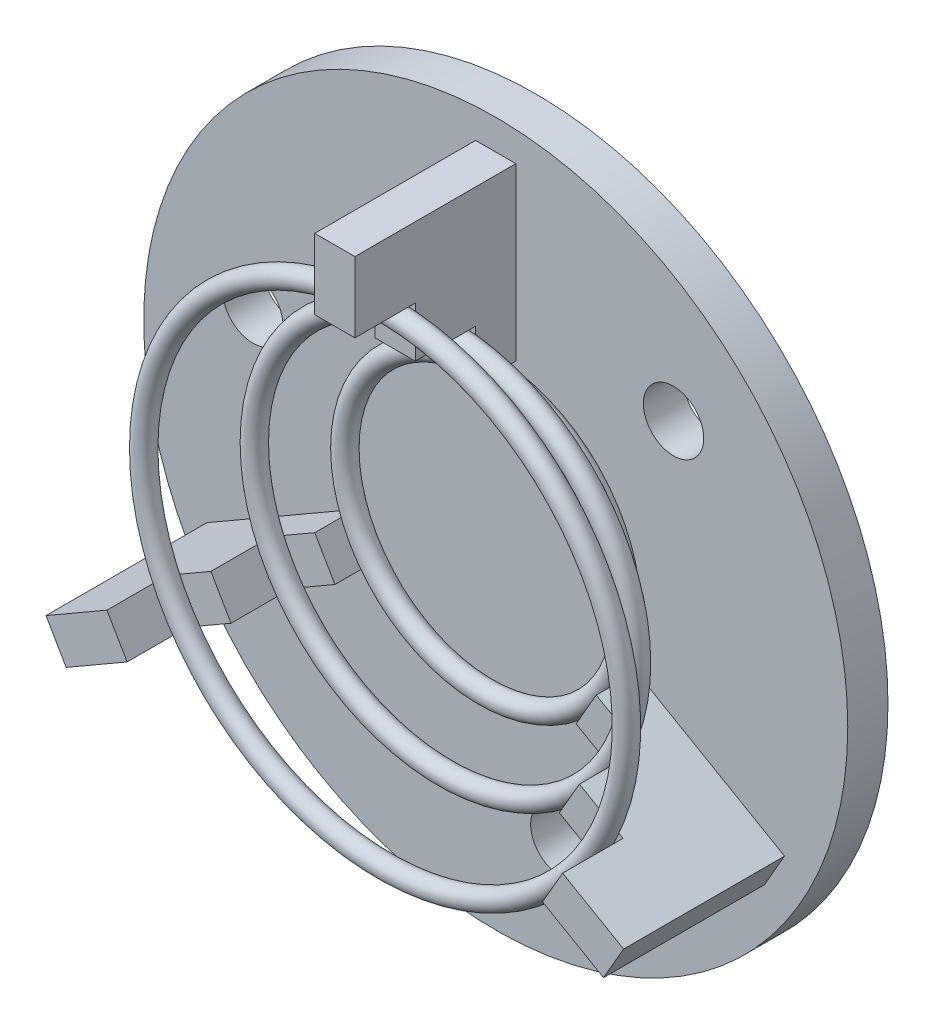
ISO-10303-21;
HEADER;
FILE_DESCRIPTION(('STEP AP214'),'2;1');
FILE_NAME('part.step','',(''),(''),'','','');
FILE_SCHEMA(('AUTOMOTIVE_DESIGN { 1 0 10303 214 1 1 1 1 }'));
ENDSEC;
DATA;
#1=APPLICATION_CONTEXT('core data for automotive mechanical design processes');
#2=APPLICATION_PROTOCOL_DEFINITION('international standard','automotive_design',2000,#1);
#3=PRODUCT_CONTEXT('',#1,'mechanical');
#4=PRODUCT('Part','Part','',(#3));
#5=PRODUCT_RELATED_PRODUCT_CATEGORY('part','',(#4));
#6=PRODUCT_DEFINITION_FORMATION('','',#4);
#7=PRODUCT_DEFINITION_CONTEXT('part definition',#1,'design');
#8=PRODUCT_DEFINITION('design','',#6,#7);
#9=PRODUCT_DEFINITION_SHAPE('','',#8);
#10=(LENGTH_UNIT() NAMED_UNIT(*) SI_UNIT(.MILLI.,.METRE.));
#11=(NAMED_UNIT(*) PLANE_ANGLE_UNIT() SI_UNIT($,.RADIAN.));
#12=(NAMED_UNIT(*) SI_UNIT($,.STERADIAN.) SOLID_ANGLE_UNIT());
#13=UNCERTAINTY_MEASURE_WITH_UNIT(LENGTH_MEASURE(1.E-05),#10,'distance_accuracy_value','');
#14=(GEOMETRIC_REPRESENTATION_CONTEXT(3) GLOBAL_UNCERTAINTY_ASSIGNED_CONTEXT((#13)) GLOBAL_UNIT_ASSIGNED_CONTEXT((#10,
#11,#12)) REPRESENTATION_CONTEXT('',''));
#15=CARTESIAN_POINT('',(0.,0.,0.));
#16=DIRECTION('',(0.,0.,1.));
#17=DIRECTION('',(1.,0.,0.));
#18=AXIS2_PLACEMENT_3D('',#15,#16,#17);
#19=CARTESIAN_POINT('',(0.,0.,7.5));
#20=DIRECTION('',(0.,0.,1.));
#21=DIRECTION('',(1.,0.,0.));
#22=AXIS2_PLACEMENT_3D('',#19,#20,#21);
#23=TOROIDAL_SURFACE('',#22,12.,0.500000000000001);
#24=CARTESIAN_POINT('',(-12.,0.,7.5));
#25=DIRECTION('',(0.,1.,0.));
#26=DIRECTION('',(0.,0.,1.));
#27=AXIS2_PLACEMENT_3D('',#24,#25,#26);
#28=CIRCLE('',#27,0.500000000000001);
#29=CARTESIAN_POINT('',(-12.5,0.,7.5));
#30=VERTEX_POINT('',#29);
#31=EDGE_CURVE('E11',#30,#30,#28,.T.);
#32=CARTESIAN_POINT('',(0.,0.,7.5));
#33=DIRECTION('',(0.,0.,1.));
#34=DIRECTION('',(1.,0.,0.));
#35=AXIS2_PLACEMENT_3D('',#32,#33,#34);
#36=CIRCLE('',#35,12.5);
#37=EDGE_CURVE('',#30,#30,#36,.T.);
#38=ORIENTED_EDGE('',*,*,#31,.F.);
#39=ORIENTED_EDGE('',*,*,#31,.T.);
#40=ORIENTED_EDGE('',*,*,#37,.T.);
#41=ORIENTED_EDGE('',*,*,#37,.F.);
#42=EDGE_LOOP('',(#38,#40,#39,#41));
#43=FACE_BOUND('',#42,.T.);
#44=ADVANCED_FACE('F43',(#43),#23,.T.);
#45=CLOSED_SHELL('',(#44));
#46=MANIFOLD_SOLID_BREP('B2',#45);
#47=CARTESIAN_POINT('',(0.,0.,4.5));
#48=DIRECTION('',(0.,0.,1.));
#49=DIRECTION('',(1.,0.,0.));
#50=AXIS2_PLACEMENT_3D('',#47,#48,#49);
#51=TOROIDAL_SURFACE('',#50,9.5,0.500000000000001);
#52=CARTESIAN_POINT('',(-9.5,0.,4.5));
#53=DIRECTION('',(0.,1.,0.));
#54=DIRECTION('',(0.,0.,1.));
#55=AXIS2_PLACEMENT_3D('',#52,#53,#54);
#56=CIRCLE('',#55,0.500000000000001);
#57=CARTESIAN_POINT('',(-10.,0.,4.5));
#58=VERTEX_POINT('',#57);
#59=EDGE_CURVE('E42',#58,#58,#56,.T.);
#60=CARTESIAN_POINT('',(0.,0.,4.5));
#61=DIRECTION('',(0.,0.,1.));
#62=DIRECTION('',(1.,0.,0.));
#63=AXIS2_PLACEMENT_3D('',#60,#61,#62);
#64=CIRCLE('',#63,10.);
#65=EDGE_CURVE('',#58,#58,#64,.T.);
#66=ORIENTED_EDGE('',*,*,#59,.F.);
#67=ORIENTED_EDGE('',*,*,#59,.T.);
#68=ORIENTED_EDGE('',*,*,#65,.T.);
#69=ORIENTED_EDGE('',*,*,#65,.F.);
#70=EDGE_LOOP('',(#66,#68,#67,#69));
#71=FACE_BOUND('',#70,.T.);
#72=ADVANCED_FACE('F67',(#71),#51,.T.);
#73=CLOSED_SHELL('',(#72));
#74=MANIFOLD_SOLID_BREP('B6',#73);
#75=CARTESIAN_POINT('',(0.,0.,2.5));
#76=DIRECTION('',(0.,0.,1.));
#77=DIRECTION('',(1.,0.,0.));
#78=AXIS2_PLACEMENT_3D('',#75,#76,#77);
#79=TOROIDAL_SURFACE('',#78,7.,0.5);
#80=CARTESIAN_POINT('',(-7.,0.,2.5));
#81=DIRECTION('',(0.,1.,0.));
#82=DIRECTION('',(0.,0.,1.));
#83=AXIS2_PLACEMENT_3D('',#80,#81,#82);
#84=CIRCLE('',#83,0.5);
#85=CARTESIAN_POINT('',(-7.5,0.,2.5));
#86=VERTEX_POINT('',#85);
#87=EDGE_CURVE('E66',#86,#86,#84,.T.);
#88=CARTESIAN_POINT('',(0.,0.,2.5));
#89=DIRECTION('',(0.,0.,1.));
#90=DIRECTION('',(1.,0.,0.));
#91=AXIS2_PLACEMENT_3D('',#88,#89,#90);
#92=CIRCLE('',#91,7.5);
#93=EDGE_CURVE('',#86,#86,#92,.T.);
#94=ORIENTED_EDGE('',*,*,#87,.F.);
#95=ORIENTED_EDGE('',*,*,#87,.T.);
#96=ORIENTED_EDGE('',*,*,#93,.T.);
#97=ORIENTED_EDGE('',*,*,#93,.F.);
#98=EDGE_LOOP('',(#94,#96,#95,#97));
#99=FACE_BOUND('',#98,.T.);
#100=ADVANCED_FACE('F92',(#99),#79,.T.);
#101=CLOSED_SHELL('',(#100));
#102=MANIFOLD_SOLID_BREP('B37',#101);
#103=CARTESIAN_POINT('',(5.99519052838327,-4.61602540378447,10.));
#104=DIRECTION('',(0.500000000000004,0.866025403784436,0.));
#105=DIRECTION('',(-0.866025403784436,0.500000000000004,0.));
#106=AXIS2_PLACEMENT_3D('',#103,#104,#105);
#107=PLANE('',#106);
#108=DIRECTION('',(0.,0.,1.));
#109=VECTOR('',#108,1.);
#110=CARTESIAN_POINT('',(10.3253175473055,-7.11602540378449,7.));
#111=LINE('',#110,#109);
#112=CARTESIAN_POINT('',(10.3253175473055,-7.11602540378449,7.));
#113=VERTEX_POINT('',#112);
#114=CARTESIAN_POINT('',(10.3253175473055,-7.11602540378449,10.));
#115=VERTEX_POINT('',#114);
#116=EDGE_CURVE('E289',#113,#115,#111,.T.);
#117=ORIENTED_EDGE('',*,*,#116,.F.);
#118=DIRECTION('',(0.866025403784436,-0.500000000000004,0.));
#119=VECTOR('',#118,1.);
#120=CARTESIAN_POINT('',(-0.500000000000004,-0.866025403784436,7.));
#121=LINE('',#120,#119);
#122=CARTESIAN_POINT('',(8.16025403784436,-5.86602540378448,7.));
#123=VERTEX_POINT('',#122);
#124=EDGE_CURVE('E290',#123,#113,#121,.T.);
#125=ORIENTED_EDGE('',*,*,#124,.F.);
#126=DIRECTION('',(0.,0.,1.));
#127=VECTOR('',#126,1.);
#128=CARTESIAN_POINT('',(8.16025403784436,-5.86602540378448,4.));
#129=LINE('',#128,#127);
#130=CARTESIAN_POINT('',(8.16025403784436,-5.86602540378448,4.));
#131=VERTEX_POINT('',#130);
#132=EDGE_CURVE('E337',#131,#123,#129,.T.);
#133=ORIENTED_EDGE('',*,*,#132,.F.);
#134=DIRECTION('',(0.866025403784436,-0.500000000000004,0.));
#135=VECTOR('',#134,1.);
#136=CARTESIAN_POINT('',(-0.500000000000004,-0.866025403784436,4.));
#137=LINE('',#136,#135);
#138=CARTESIAN_POINT('',(5.99519052838327,-4.61602540378447,4.));
#139=VERTEX_POINT('',#138);
#140=EDGE_CURVE('E334',#139,#131,#137,.T.);
#141=ORIENTED_EDGE('',*,*,#140,.F.);
#142=DIRECTION('',(0.,0.,-1.));
#143=VECTOR('',#142,1.);
#144=CARTESIAN_POINT('',(5.99519052838327,-4.61602540378447,10.));
#145=LINE('',#144,#143);
#146=CARTESIAN_POINT('',(5.99519052838327,-4.61602540378447,2.));
#147=VERTEX_POINT('',#146);
#148=EDGE_CURVE('E392',#139,#147,#145,.T.);
#149=ORIENTED_EDGE('',*,*,#148,.T.);
#150=DIRECTION('',(-0.866025403784436,0.500000000000004,0.));
#151=VECTOR('',#150,1.);
#152=CARTESIAN_POINT('',(-0.500000000000004,-0.866025403784436,2.));
#153=LINE('',#152,#151);
#154=CARTESIAN_POINT('',(13.356406460551,-8.8660254037845,2.));
#155=VERTEX_POINT('',#154);
#156=EDGE_CURVE('E406',#155,#147,#153,.T.);
#157=ORIENTED_EDGE('',*,*,#156,.F.);
#158=DIRECTION('',(0.,0.,-1.));
#159=VECTOR('',#158,1.);
#160=CARTESIAN_POINT('',(13.356406460551,-8.8660254037845,10.));
#161=LINE('',#160,#159);
#162=CARTESIAN_POINT('',(13.356406460551,-8.8660254037845,10.));
#163=VERTEX_POINT('',#162);
#164=EDGE_CURVE('E395',#163,#155,#161,.T.);
#165=ORIENTED_EDGE('',*,*,#164,.F.);
#166=DIRECTION('',(0.866025403784436,-0.500000000000004,0.));
#167=VECTOR('',#166,1.);
#168=CARTESIAN_POINT('',(5.99519052838327,-4.61602540378447,10.));
#169=LINE('',#168,#167);
#170=EDGE_CURVE('E389',#115,#163,#169,.T.);
#171=ORIENTED_EDGE('',*,*,#170,.F.);
#172=EDGE_LOOP('',(#117,#125,#133,#141,#149,#157,#165,#171));
#173=FACE_BOUND('',#172,.T.);
#174=ADVANCED_FACE('F108',(#173),#107,.F.);
#175=CARTESIAN_POINT('',(6.99519052838328,-2.88397459621559,10.));
#176=DIRECTION('',(0.500000000000004,0.866025403784436,0.));
#177=DIRECTION('',(-0.866025403784436,0.500000000000004,0.));
#178=AXIS2_PLACEMENT_3D('',#175,#176,#177);
#179=PLANE('',#178);
#180=DIRECTION('',(0.866025403784436,-0.500000000000004,0.));
#181=VECTOR('',#180,1.);
#182=CARTESIAN_POINT('',(0.500000000000004,0.866025403784436,7.));
#183=LINE('',#182,#181);
#184=CARTESIAN_POINT('',(9.16025403784437,-4.1339745962156,7.));
#185=VERTEX_POINT('',#184);
#186=CARTESIAN_POINT('',(11.3253175473055,-5.38397459621561,7.));
#187=VERTEX_POINT('',#186);
#188=EDGE_CURVE('E133',#185,#187,#183,.T.);
#189=ORIENTED_EDGE('',*,*,#188,.T.);
#190=DIRECTION('',(0.,0.,1.));
#191=VECTOR('',#190,1.);
#192=CARTESIAN_POINT('',(11.3253175473055,-5.38397459621561,7.));
#193=LINE('',#192,#191);
#194=CARTESIAN_POINT('',(11.3253175473055,-5.38397459621561,10.));
#195=VERTEX_POINT('',#194);
#196=EDGE_CURVE('E281',#187,#195,#193,.T.);
#197=ORIENTED_EDGE('',*,*,#196,.T.);
#198=DIRECTION('',(0.866025403784436,-0.500000000000004,0.));
#199=VECTOR('',#198,1.);
#200=CARTESIAN_POINT('',(6.99519052838328,-2.88397459621559,10.));
#201=LINE('',#200,#199);
#202=CARTESIAN_POINT('',(14.356406460551,-7.13397459621563,10.));
#203=VERTEX_POINT('',#202);
#204=EDGE_CURVE('E384',#195,#203,#201,.T.);
#205=ORIENTED_EDGE('',*,*,#204,.T.);
#206=DIRECTION('',(0.,0.,-1.));
#207=VECTOR('',#206,1.);
#208=CARTESIAN_POINT('',(14.356406460551,-7.13397459621563,10.));
#209=LINE('',#208,#207);
#210=CARTESIAN_POINT('',(14.356406460551,-7.13397459621563,2.));
#211=VERTEX_POINT('',#210);
#212=EDGE_CURVE('E398',#203,#211,#209,.T.);
#213=ORIENTED_EDGE('',*,*,#212,.T.);
#214=DIRECTION('',(-0.866025403784436,0.500000000000004,0.));
#215=VECTOR('',#214,1.);
#216=CARTESIAN_POINT('',(0.500000000000004,0.866025403784436,2.));
#217=LINE('',#216,#215);
#218=CARTESIAN_POINT('',(6.99519052838328,-2.88397459621559,2.));
#219=VERTEX_POINT('',#218);
#220=EDGE_CURVE('E394',#211,#219,#217,.T.);
#221=ORIENTED_EDGE('',*,*,#220,.T.);
#222=DIRECTION('',(0.,0.,-1.));
#223=VECTOR('',#222,1.);
#224=CARTESIAN_POINT('',(6.99519052838328,-2.88397459621559,10.));
#225=LINE('',#224,#223);
#226=CARTESIAN_POINT('',(6.99519052838328,-2.88397459621559,4.));
#227=VERTEX_POINT('',#226);
#228=EDGE_CURVE('E391',#227,#219,#225,.T.);
#229=ORIENTED_EDGE('',*,*,#228,.F.);
#230=DIRECTION('',(0.866025403784436,-0.500000000000004,0.));
#231=VECTOR('',#230,1.);
#232=CARTESIAN_POINT('',(0.500000000000004,0.866025403784436,4.));
#233=LINE('',#232,#231);
#234=CARTESIAN_POINT('',(9.16025403784437,-4.1339745962156,4.));
#235=VERTEX_POINT('',#234);
#236=EDGE_CURVE('E328',#227,#235,#233,.T.);
#237=ORIENTED_EDGE('',*,*,#236,.T.);
#238=DIRECTION('',(0.,0.,1.));
#239=VECTOR('',#238,1.);
#240=CARTESIAN_POINT('',(9.16025403784437,-4.1339745962156,4.));
#241=LINE('',#240,#239);
#242=EDGE_CURVE('E299',#235,#185,#241,.T.);
#243=ORIENTED_EDGE('',*,*,#242,.T.);
#244=EDGE_LOOP('',(#189,#197,#205,#213,#221,#229,#237,#243));
#245=FACE_BOUND('',#244,.T.);
#246=ADVANCED_FACE('F297',(#245),#179,.T.);
#247=CARTESIAN_POINT('',(0.,0.,10.));
#248=DIRECTION('',(0.,0.,-1.));
#249=DIRECTION('',(0.500000000000004,0.866025403784436,0.));
#250=AXIS2_PLACEMENT_3D('',#247,#248,#249);
#251=PLANE('',#250);
#252=DIRECTION('',(-0.500000000000004,-0.866025403784436,0.));
#253=VECTOR('',#252,1.);
#254=CARTESIAN_POINT('',(10.8253175473055,-6.25000000000005,10.));
#255=LINE('',#254,#253);
#256=EDGE_CURVE('E286',#195,#115,#255,.T.);
#257=ORIENTED_EDGE('',*,*,#256,.T.);
#258=ORIENTED_EDGE('',*,*,#170,.T.);
#259=DIRECTION('',(0.500000000000004,0.866025403784436,0.));
#260=VECTOR('',#259,1.);
#261=CARTESIAN_POINT('',(13.356406460551,-8.8660254037845,10.));
#262=LINE('',#261,#260);
#263=EDGE_CURVE('E386',#163,#203,#262,.T.);
#264=ORIENTED_EDGE('',*,*,#263,.T.);
#265=ORIENTED_EDGE('',*,*,#204,.F.);
#266=EDGE_LOOP('',(#257,#258,#264,#265));
#267=FACE_BOUND('',#266,.T.);
#268=ADVANCED_FACE('F513',(#267),#251,.F.);
#269=CARTESIAN_POINT('',(-6.99519052838332,-2.8839745962155,10.));
#270=DIRECTION('',(0.499999999999992,-0.866025403784443,0.));
#271=DIRECTION('',(0.866025403784443,0.499999999999992,0.));
#272=AXIS2_PLACEMENT_3D('',#269,#270,#271);
#273=PLANE('',#272);
#274=DIRECTION('',(0.,0.,1.));
#275=VECTOR('',#274,1.);
#276=CARTESIAN_POINT('',(-11.3253175473055,-5.38397459621546,7.));
#277=LINE('',#276,#275);
#278=CARTESIAN_POINT('',(-11.3253175473055,-5.38397459621546,7.));
#279=VERTEX_POINT('',#278);
#280=CARTESIAN_POINT('',(-11.3253175473055,-5.38397459621546,10.));
#281=VERTEX_POINT('',#280);
#282=EDGE_CURVE('E307',#279,#281,#277,.T.);
#283=ORIENTED_EDGE('',*,*,#282,.F.);
#284=DIRECTION('',(-0.866025403784443,-0.499999999999992,0.));
#285=VECTOR('',#284,1.);
#286=CARTESIAN_POINT('',(-0.499999999999992,0.866025403784443,7.));
#287=LINE('',#286,#285);
#288=CARTESIAN_POINT('',(-9.16025403784442,-4.13397459621548,7.));
#289=VERTEX_POINT('',#288);
#290=EDGE_CURVE('E316',#289,#279,#287,.T.);
#291=ORIENTED_EDGE('',*,*,#290,.F.);
#292=DIRECTION('',(0.,0.,1.));
#293=VECTOR('',#292,1.);
#294=CARTESIAN_POINT('',(-9.16025403784442,-4.13397459621548,4.));
#295=LINE('',#294,#293);
#296=CARTESIAN_POINT('',(-9.16025403784442,-4.13397459621548,4.));
#297=VERTEX_POINT('',#296);
#298=EDGE_CURVE('E329',#297,#289,#295,.T.);
#299=ORIENTED_EDGE('',*,*,#298,.F.);
#300=DIRECTION('',(-0.866025403784443,-0.499999999999992,0.));
#301=VECTOR('',#300,1.);
#302=CARTESIAN_POINT('',(-0.499999999999992,0.866025403784443,4.));
#303=LINE('',#302,#301);
#304=CARTESIAN_POINT('',(-6.99519052838332,-2.8839745962155,4.));
#305=VERTEX_POINT('',#304);
#306=EDGE_CURVE('E349',#305,#297,#303,.T.);
#307=ORIENTED_EDGE('',*,*,#306,.F.);
#308=DIRECTION('',(0.,0.,-1.));
#309=VECTOR('',#308,1.);
#310=CARTESIAN_POINT('',(-6.99519052838332,-2.8839745962155,10.));
#311=LINE('',#310,#309);
#312=CARTESIAN_POINT('',(-6.99519052838332,-2.8839745962155,2.));
#313=VERTEX_POINT('',#312);
#314=EDGE_CURVE('E364',#305,#313,#311,.T.);
#315=ORIENTED_EDGE('',*,*,#314,.T.);
#316=DIRECTION('',(0.866025403784443,0.499999999999992,0.));
#317=VECTOR('',#316,1.);
#318=CARTESIAN_POINT('',(-0.499999999999992,0.866025403784443,2.));
#319=LINE('',#318,#317);
#320=CARTESIAN_POINT('',(-14.3564064605511,-7.13397459621543,2.));
#321=VERTEX_POINT('',#320);
#322=EDGE_CURVE('E378',#321,#313,#319,.T.);
#323=ORIENTED_EDGE('',*,*,#322,.F.);
#324=DIRECTION('',(0.,0.,-1.));
#325=VECTOR('',#324,1.);
#326=CARTESIAN_POINT('',(-14.3564064605511,-7.13397459621543,10.));
#327=LINE('',#326,#325);
#328=CARTESIAN_POINT('',(-14.3564064605511,-7.13397459621543,10.));
#329=VERTEX_POINT('',#328);
#330=EDGE_CURVE('E367',#329,#321,#327,.T.);
#331=ORIENTED_EDGE('',*,*,#330,.F.);
#332=DIRECTION('',(-0.866025403784443,-0.499999999999992,0.));
#333=VECTOR('',#332,1.);
#334=CARTESIAN_POINT('',(-6.99519052838332,-2.8839745962155,10.));
#335=LINE('',#334,#333);
#336=EDGE_CURVE('E361',#281,#329,#335,.T.);
#337=ORIENTED_EDGE('',*,*,#336,.F.);
#338=EDGE_LOOP('',(#283,#291,#299,#307,#315,#323,#331,#337));
#339=FACE_BOUND('',#338,.T.);
#340=ADVANCED_FACE('F598',(#339),#273,.F.);
#341=CARTESIAN_POINT('',(-5.99519052838333,-4.61602540378438,10.));
#342=DIRECTION('',(0.499999999999992,-0.866025403784443,0.));
#343=DIRECTION('',(0.866025403784443,0.499999999999992,0.));
#344=AXIS2_PLACEMENT_3D('',#341,#342,#343);
#345=PLANE('',#344);
#346=DIRECTION('',(-0.866025403784443,-0.499999999999992,0.));
#347=VECTOR('',#346,1.);
#348=CARTESIAN_POINT('',(0.499999999999992,-0.866025403784443,7.));
#349=LINE('',#348,#347);
#350=CARTESIAN_POINT('',(-8.16025403784444,-5.86602540378436,7.));
#351=VERTEX_POINT('',#350);
#352=CARTESIAN_POINT('',(-10.3253175473056,-7.11602540378434,7.));
#353=VERTEX_POINT('',#352);
#354=EDGE_CURVE('E125',#351,#353,#349,.T.);
#355=ORIENTED_EDGE('',*,*,#354,.T.);
#356=DIRECTION('',(0.,0.,1.));
#357=VECTOR('',#356,1.);
#358=CARTESIAN_POINT('',(-10.3253175473056,-7.11602540378434,7.));
#359=LINE('',#358,#357);
#360=CARTESIAN_POINT('',(-10.3253175473056,-7.11602540378434,10.));
#361=VERTEX_POINT('',#360);
#362=EDGE_CURVE('E319',#353,#361,#359,.T.);
#363=ORIENTED_EDGE('',*,*,#362,.T.);
#364=DIRECTION('',(-0.866025403784443,-0.499999999999992,0.));
#365=VECTOR('',#364,1.);
#366=CARTESIAN_POINT('',(-5.99519052838333,-4.61602540378438,10.));
#367=LINE('',#366,#365);
#368=CARTESIAN_POINT('',(-13.3564064605511,-8.86602540378431,10.));
#369=VERTEX_POINT('',#368);
#370=EDGE_CURVE('E340',#361,#369,#367,.T.);
#371=ORIENTED_EDGE('',*,*,#370,.T.);
#372=DIRECTION('',(0.,0.,-1.));
#373=VECTOR('',#372,1.);
#374=CARTESIAN_POINT('',(-13.3564064605511,-8.86602540378431,10.));
#375=LINE('',#374,#373);
#376=CARTESIAN_POINT('',(-13.3564064605511,-8.86602540378431,2.));
#377=VERTEX_POINT('',#376);
#378=EDGE_CURVE('E370',#369,#377,#375,.T.);
#379=ORIENTED_EDGE('',*,*,#378,.T.);
#380=DIRECTION('',(0.866025403784443,0.499999999999992,0.));
#381=VECTOR('',#380,1.);
#382=CARTESIAN_POINT('',(0.499999999999992,-0.866025403784443,2.));
#383=LINE('',#382,#381);
#384=CARTESIAN_POINT('',(-5.99519052838333,-4.61602540378438,2.));
#385=VERTEX_POINT('',#384);
#386=EDGE_CURVE('E366',#377,#385,#383,.T.);
#387=ORIENTED_EDGE('',*,*,#386,.T.);
#388=DIRECTION('',(0.,0.,-1.));
#389=VECTOR('',#388,1.);
#390=CARTESIAN_POINT('',(-5.99519052838333,-4.61602540378438,10.));
#391=LINE('',#390,#389);
#392=CARTESIAN_POINT('',(-5.99519052838333,-4.61602540378438,4.));
#393=VERTEX_POINT('',#392);
#394=EDGE_CURVE('E363',#393,#385,#391,.T.);
#395=ORIENTED_EDGE('',*,*,#394,.F.);
#396=DIRECTION('',(-0.866025403784443,-0.499999999999992,0.));
#397=VECTOR('',#396,1.);
#398=CARTESIAN_POINT('',(0.499999999999992,-0.866025403784443,4.));
#399=LINE('',#398,#397);
#400=CARTESIAN_POINT('',(-8.16025403784444,-5.86602540378436,4.));
#401=VERTEX_POINT('',#400);
#402=EDGE_CURVE('E343',#393,#401,#399,.T.);
#403=ORIENTED_EDGE('',*,*,#402,.T.);
#404=DIRECTION('',(0.,0.,1.));
#405=VECTOR('',#404,1.);
#406=CARTESIAN_POINT('',(-8.16025403784444,-5.86602540378436,4.));
#407=LINE('',#406,#405);
#408=EDGE_CURVE('E352',#401,#351,#407,.T.);
#409=ORIENTED_EDGE('',*,*,#408,.T.);
#410=EDGE_LOOP('',(#355,#363,#371,#379,#387,#395,#403,#409));
#411=FACE_BOUND('',#410,.T.);
#412=ADVANCED_FACE('F592',(#411),#345,.T.);
#413=CARTESIAN_POINT('',(0.,0.,10.));
#414=DIRECTION('',(0.,0.,-1.));
#415=DIRECTION('',(0.499999999999992,-0.866025403784443,0.));
#416=AXIS2_PLACEMENT_3D('',#413,#414,#415);
#417=PLANE('',#416);
#418=DIRECTION('',(-0.499999999999992,0.866025403784443,0.));
#419=VECTOR('',#418,1.);
#420=CARTESIAN_POINT('',(-10.8253175473055,-6.2499999999999,10.));
#421=LINE('',#420,#419);
#422=EDGE_CURVE('E312',#361,#281,#421,.T.);
#423=ORIENTED_EDGE('',*,*,#422,.T.);
#424=ORIENTED_EDGE('',*,*,#336,.T.);
#425=DIRECTION('',(0.499999999999992,-0.866025403784443,0.));
#426=VECTOR('',#425,1.);
#427=CARTESIAN_POINT('',(-14.3564064605511,-7.13397459621543,10.));
#428=LINE('',#427,#426);
#429=EDGE_CURVE('E358',#329,#369,#428,.T.);
#430=ORIENTED_EDGE('',*,*,#429,.T.);
#431=ORIENTED_EDGE('',*,*,#370,.F.);
#432=EDGE_LOOP('',(#423,#424,#430,#431));
#433=FACE_BOUND('',#432,.T.);
#434=ADVANCED_FACE('F601',(#433),#417,.F.);
#435=CARTESIAN_POINT('',(-8.66025403784443,-4.99999999999992,4.));
#436=DIRECTION('',(0.866025403784443,0.499999999999992,0.));
#437=DIRECTION('',(-0.499999999999992,0.866025403784443,0.));
#438=AXIS2_PLACEMENT_3D('',#435,#436,#437);
#439=PLANE('',#438);
#440=ORIENTED_EDGE('',*,*,#298,.T.);
#441=DIRECTION('',(-0.499999999999992,0.866025403784443,0.));
#442=VECTOR('',#441,1.);
#443=CARTESIAN_POINT('',(-8.66025403784443,-4.99999999999992,7.));
#444=LINE('',#443,#442);
#445=EDGE_CURVE('E314',#351,#289,#444,.T.);
#446=ORIENTED_EDGE('',*,*,#445,.F.);
#447=ORIENTED_EDGE('',*,*,#408,.F.);
#448=DIRECTION('',(-0.499999999999992,0.866025403784443,0.));
#449=VECTOR('',#448,1.);
#450=CARTESIAN_POINT('',(-8.66025403784443,-4.99999999999992,4.));
#451=LINE('',#450,#449);
#452=EDGE_CURVE('E308',#401,#297,#451,.T.);
#453=ORIENTED_EDGE('',*,*,#452,.T.);
#454=EDGE_LOOP('',(#440,#446,#447,#453));
#455=FACE_BOUND('',#454,.T.);
#456=ADVANCED_FACE('F607',(#455),#439,.T.);
#457=CARTESIAN_POINT('',(8.66025403784437,-5.00000000000004,4.));
#458=DIRECTION('',(-0.866025403784436,0.500000000000004,0.));
#459=DIRECTION('',(-0.500000000000004,-0.866025403784436,0.));
#460=AXIS2_PLACEMENT_3D('',#457,#458,#459);
#461=PLANE('',#460);
#462=ORIENTED_EDGE('',*,*,#132,.T.);
#463=DIRECTION('',(-0.500000000000004,-0.866025403784436,0.));
#464=VECTOR('',#463,1.);
#465=CARTESIAN_POINT('',(8.66025403784437,-5.00000000000004,7.));
#466=LINE('',#465,#464);
#467=EDGE_CURVE('E300',#185,#123,#466,.T.);
#468=ORIENTED_EDGE('',*,*,#467,.F.);
#469=ORIENTED_EDGE('',*,*,#242,.F.);
#470=DIRECTION('',(-0.500000000000004,-0.866025403784436,0.));
#471=VECTOR('',#470,1.);
#472=CARTESIAN_POINT('',(8.66025403784437,-5.00000000000004,4.));
#473=LINE('',#472,#471);
#474=EDGE_CURVE('E326',#235,#131,#473,.T.);
#475=ORIENTED_EDGE('',*,*,#474,.T.);
#476=EDGE_LOOP('',(#462,#468,#469,#475));
#477=FACE_BOUND('',#476,.T.);
#478=ADVANCED_FACE('F628',(#477),#461,.T.);
#479=CARTESIAN_POINT('',(6.49519052838327,-3.75000000000003,10.));
#480=DIRECTION('',(0.866025403784436,-0.500000000000004,0.));
#481=DIRECTION('',(0.500000000000004,0.866025403784436,0.));
#482=AXIS2_PLACEMENT_3D('',#479,#480,#481);
#483=PLANE('',#482);
#484=DIRECTION('',(0.500000000000004,0.866025403784436,0.));
#485=VECTOR('',#484,1.);
#486=CARTESIAN_POINT('',(6.49519052838327,-3.75000000000003,4.));
#487=LINE('',#486,#485);
#488=EDGE_CURVE('E331',#139,#227,#487,.T.);
#489=ORIENTED_EDGE('',*,*,#488,.T.);
#490=ORIENTED_EDGE('',*,*,#228,.T.);
#491=DIRECTION('',(0.500000000000004,0.866025403784436,0.));
#492=VECTOR('',#491,1.);
#493=CARTESIAN_POINT('',(6.49519052838327,-3.75000000000003,2.));
#494=LINE('',#493,#492);
#495=EDGE_CURVE('E409',#147,#219,#494,.T.);
#496=ORIENTED_EDGE('',*,*,#495,.F.);
#497=ORIENTED_EDGE('',*,*,#148,.F.);
#498=EDGE_LOOP('',(#489,#490,#496,#497));
#499=FACE_BOUND('',#498,.T.);
#500=ADVANCED_FACE('F517',(#499),#483,.F.);
#501=CARTESIAN_POINT('',(-6.49519052838332,-3.74999999999994,10.));
#502=DIRECTION('',(-0.866025403784443,-0.499999999999992,0.));
#503=DIRECTION('',(0.499999999999992,-0.866025403784443,0.));
#504=AXIS2_PLACEMENT_3D('',#501,#502,#503);
#505=PLANE('',#504);
#506=DIRECTION('',(0.499999999999992,-0.866025403784443,0.));
#507=VECTOR('',#506,1.);
#508=CARTESIAN_POINT('',(-6.49519052838332,-3.74999999999994,4.));
#509=LINE('',#508,#507);
#510=EDGE_CURVE('E346',#305,#393,#509,.T.);
#511=ORIENTED_EDGE('',*,*,#510,.T.);
#512=ORIENTED_EDGE('',*,*,#394,.T.);
#513=DIRECTION('',(0.499999999999992,-0.866025403784443,0.));
#514=VECTOR('',#513,1.);
#515=CARTESIAN_POINT('',(-6.49519052838332,-3.74999999999994,2.));
#516=LINE('',#515,#514);
#517=EDGE_CURVE('E381',#313,#385,#516,.T.);
#518=ORIENTED_EDGE('',*,*,#517,.F.);
#519=ORIENTED_EDGE('',*,*,#314,.F.);
#520=EDGE_LOOP('',(#511,#512,#518,#519));
#521=FACE_BOUND('',#520,.T.);
#522=ADVANCED_FACE('F562',(#521),#505,.F.);
#523=CARTESIAN_POINT('',(0.,0.,2.));
#524=DIRECTION('',(0.,0.,1.));
#525=DIRECTION('',(1.,0.,0.));
#526=AXIS2_PLACEMENT_3D('',#523,#524,#525);
#527=PLANE('',#526);
#528=CARTESIAN_POINT('',(3.23523806378238,-12.0740728286136,2.));
#529=DIRECTION('',(0.,0.,1.));
#530=DIRECTION('',(1.,0.,0.));
#531=AXIS2_PLACEMENT_3D('',#528,#529,#530);
#532=CIRCLE('',#531,1.5);
#533=CARTESIAN_POINT('',(4.73523806378238,-12.0740728286136,2.));
#534=VERTEX_POINT('',#533);
#535=EDGE_CURVE('E322',#534,#534,#532,.T.);
#536=ORIENTED_EDGE('',*,*,#535,.F.);
#537=EDGE_LOOP('',(#536));
#538=FACE_BOUND('',#537,.T.);
#539=CARTESIAN_POINT('',(8.83883476483185,8.83883476483184,2.));
#540=DIRECTION('',(0.,0.,1.));
#541=DIRECTION('',(1.,0.,0.));
#542=AXIS2_PLACEMENT_3D('',#539,#540,#541);
#543=CIRCLE('',#542,1.5);
#544=CARTESIAN_POINT('',(10.3388347648318,8.83883476483184,2.));
#545=VERTEX_POINT('',#544);
#546=EDGE_CURVE('E480',#545,#545,#543,.T.);
#547=ORIENTED_EDGE('',*,*,#546,.F.);
#548=EDGE_LOOP('',(#547));
#549=FACE_BOUND('',#548,.T.);
#550=CARTESIAN_POINT('',(-12.0740728286131,3.23523806378064,2.));
#551=DIRECTION('',(0.,0.,1.));
#552=DIRECTION('',(1.,0.,0.));
#553=AXIS2_PLACEMENT_3D('',#550,#551,#552);
#554=CIRCLE('',#553,1.50000000000082);
#555=CARTESIAN_POINT('',(-10.5740728286123,3.23523806378064,2.));
#556=VERTEX_POINT('',#555);
#557=EDGE_CURVE('E477',#556,#556,#554,.T.);
#558=ORIENTED_EDGE('',*,*,#557,.F.);
#559=EDGE_LOOP('',(#558));
#560=FACE_BOUND('',#559,.T.);
#561=CARTESIAN_POINT('',(0.,0.,2.));
#562=DIRECTION('',(0.,0.,1.));
#563=DIRECTION('',(1.,0.,0.));
#564=AXIS2_PLACEMENT_3D('',#561,#562,#563);
#565=CIRCLE('',#564,17.5);
#566=CARTESIAN_POINT('',(17.5,0.,2.));
#567=VERTEX_POINT('',#566);
#568=EDGE_CURVE('E90',#567,#567,#565,.T.);
#569=ORIENTED_EDGE('',*,*,#568,.T.);
#570=EDGE_LOOP('',(#569));
#571=FACE_BOUND('',#570,.T.);
#572=DIRECTION('',(0.,-1.,0.));
#573=VECTOR('',#572,1.);
#574=CARTESIAN_POINT('',(1.,0.,2.));
#575=LINE('',#574,#573);
#576=CARTESIAN_POINT('',(1.,16.,2.));
#577=VERTEX_POINT('',#576);
#578=CARTESIAN_POINT('',(1.,7.5,2.));
#579=VERTEX_POINT('',#578);
#580=EDGE_CURVE('E467',#577,#579,#575,.T.);
#581=ORIENTED_EDGE('',*,*,#580,.T.);
#582=DIRECTION('',(-1.,0.,0.));
#583=VECTOR('',#582,1.);
#584=CARTESIAN_POINT('',(0.,7.5,2.));
#585=LINE('',#584,#583);
#586=CARTESIAN_POINT('',(-1.,7.5,2.));
#587=VERTEX_POINT('',#586);
#588=EDGE_CURVE('E470',#579,#587,#585,.T.);
#589=ORIENTED_EDGE('',*,*,#588,.T.);
#590=DIRECTION('',(0.,-1.,0.));
#591=VECTOR('',#590,1.);
#592=CARTESIAN_POINT('',(-1.,0.,2.));
#593=LINE('',#592,#591);
#594=CARTESIAN_POINT('',(-1.,16.,2.));
#595=VERTEX_POINT('',#594);
#596=EDGE_CURVE('E455',#595,#587,#593,.T.);
#597=ORIENTED_EDGE('',*,*,#596,.F.);
#598=DIRECTION('',(1.,0.,0.));
#599=VECTOR('',#598,1.);
#600=CARTESIAN_POINT('',(0.,16.,2.));
#601=LINE('',#600,#599);
#602=EDGE_CURVE('E465',#595,#577,#601,.T.);
#603=ORIENTED_EDGE('',*,*,#602,.T.);
#604=EDGE_LOOP('',(#581,#589,#597,#603));
#605=FACE_BOUND('',#604,.T.);
#606=ORIENTED_EDGE('',*,*,#156,.T.);
#607=ORIENTED_EDGE('',*,*,#495,.T.);
#608=ORIENTED_EDGE('',*,*,#220,.F.);
#609=DIRECTION('',(-0.500000000000004,-0.866025403784436,0.));
#610=VECTOR('',#609,1.);
#611=CARTESIAN_POINT('',(13.856406460551,-8.00000000000007,2.));
#612=LINE('',#611,#610);
#613=EDGE_CURVE('E404',#211,#155,#612,.T.);
#614=ORIENTED_EDGE('',*,*,#613,.T.);
#615=EDGE_LOOP('',(#606,#607,#608,#614));
#616=FACE_BOUND('',#615,.T.);
#617=ORIENTED_EDGE('',*,*,#322,.T.);
#618=ORIENTED_EDGE('',*,*,#517,.T.);
#619=ORIENTED_EDGE('',*,*,#386,.F.);
#620=DIRECTION('',(-0.499999999999992,0.866025403784443,0.));
#621=VECTOR('',#620,1.);
#622=CARTESIAN_POINT('',(-13.8564064605511,-7.99999999999987,2.));
#623=LINE('',#622,#621);
#624=EDGE_CURVE('E376',#377,#321,#623,.T.);
#625=ORIENTED_EDGE('',*,*,#624,.T.);
#626=EDGE_LOOP('',(#617,#618,#619,#625));
#627=FACE_BOUND('',#626,.T.);
#628=ADVANCED_FACE('F553',(#538,#549,#560,#571,#605,#616,#627),#527,.T.);
#629=CARTESIAN_POINT('',(1.,7.5,10.));
#630=DIRECTION('',(-1.,0.,0.));
#631=DIRECTION('',(0.,0.,1.));
#632=AXIS2_PLACEMENT_3D('',#629,#630,#631);
#633=PLANE('',#632);
#634=DIRECTION('',(0.,0.,1.));
#635=VECTOR('',#634,1.);
#636=CARTESIAN_POINT('',(1.,12.5,7.));
#637=LINE('',#636,#635);
#638=CARTESIAN_POINT('',(1.,12.5,7.));
#639=VERTEX_POINT('',#638);
#640=CARTESIAN_POINT('',(1.,12.5,10.));
#641=VERTEX_POINT('',#640);
#642=EDGE_CURVE('E425',#639,#641,#637,.T.);
#643=ORIENTED_EDGE('',*,*,#642,.F.);
#644=DIRECTION('',(0.,1.,0.));
#645=VECTOR('',#644,1.);
#646=CARTESIAN_POINT('',(1.,0.,7.));
#647=LINE('',#646,#645);
#648=CARTESIAN_POINT('',(1.,10.,7.));
#649=VERTEX_POINT('',#648);
#650=EDGE_CURVE('E420',#649,#639,#647,.T.);
#651=ORIENTED_EDGE('',*,*,#650,.F.);
#652=DIRECTION('',(0.,0.,1.));
#653=VECTOR('',#652,1.);
#654=CARTESIAN_POINT('',(1.,10.,4.));
#655=LINE('',#654,#653);
#656=CARTESIAN_POINT('',(1.,10.,4.));
#657=VERTEX_POINT('',#656);
#658=EDGE_CURVE('E440',#657,#649,#655,.T.);
#659=ORIENTED_EDGE('',*,*,#658,.F.);
#660=DIRECTION('',(0.,1.,0.));
#661=VECTOR('',#660,1.);
#662=CARTESIAN_POINT('',(1.,0.,4.));
#663=LINE('',#662,#661);
#664=CARTESIAN_POINT('',(1.,7.5,4.));
#665=VERTEX_POINT('',#664);
#666=EDGE_CURVE('E437',#665,#657,#663,.T.);
#667=ORIENTED_EDGE('',*,*,#666,.F.);
#668=DIRECTION('',(0.,0.,-1.));
#669=VECTOR('',#668,1.);
#670=CARTESIAN_POINT('',(1.,7.5,10.));
#671=LINE('',#670,#669);
#672=EDGE_CURVE('E453',#665,#579,#671,.T.);
#673=ORIENTED_EDGE('',*,*,#672,.T.);
#674=ORIENTED_EDGE('',*,*,#580,.F.);
#675=DIRECTION('',(0.,0.,-1.));
#676=VECTOR('',#675,1.);
#677=CARTESIAN_POINT('',(1.,16.,10.));
#678=LINE('',#677,#676);
#679=CARTESIAN_POINT('',(1.,16.,10.));
#680=VERTEX_POINT('',#679);
#681=EDGE_CURVE('E456',#680,#577,#678,.T.);
#682=ORIENTED_EDGE('',*,*,#681,.F.);
#683=DIRECTION('',(0.,1.,0.));
#684=VECTOR('',#683,1.);
#685=CARTESIAN_POINT('',(1.,7.5,10.));
#686=LINE('',#685,#684);
#687=EDGE_CURVE('E450',#641,#680,#686,.T.);
#688=ORIENTED_EDGE('',*,*,#687,.F.);
#689=EDGE_LOOP('',(#643,#651,#659,#667,#673,#674,#682,#688));
#690=FACE_BOUND('',#689,.T.);
#691=ADVANCED_FACE('F550',(#690),#633,.F.);
#692=CARTESIAN_POINT('',(-1.,7.5,10.));
#693=DIRECTION('',(-1.,0.,0.));
#694=DIRECTION('',(0.,0.,1.));
#695=AXIS2_PLACEMENT_3D('',#692,#693,#694);
#696=PLANE('',#695);
#697=DIRECTION('',(0.,1.,0.));
#698=VECTOR('',#697,1.);
#699=CARTESIAN_POINT('',(-1.,0.,7.));
#700=LINE('',#699,#698);
#701=CARTESIAN_POINT('',(-1.,10.,7.));
#702=VERTEX_POINT('',#701);
#703=CARTESIAN_POINT('',(-1.,12.5,7.));
#704=VERTEX_POINT('',#703);
#705=EDGE_CURVE('E416',#702,#704,#700,.T.);
#706=ORIENTED_EDGE('',*,*,#705,.T.);
#707=DIRECTION('',(0.,0.,1.));
#708=VECTOR('',#707,1.);
#709=CARTESIAN_POINT('',(-1.,12.5,7.));
#710=LINE('',#709,#708);
#711=CARTESIAN_POINT('',(-1.,12.5,10.));
#712=VERTEX_POINT('',#711);
#713=EDGE_CURVE('E422',#704,#712,#710,.T.);
#714=ORIENTED_EDGE('',*,*,#713,.T.);
#715=DIRECTION('',(0.,1.,0.));
#716=VECTOR('',#715,1.);
#717=CARTESIAN_POINT('',(-1.,7.5,10.));
#718=LINE('',#717,#716);
#719=CARTESIAN_POINT('',(-1.,16.,10.));
#720=VERTEX_POINT('',#719);
#721=EDGE_CURVE('E443',#712,#720,#718,.T.);
#722=ORIENTED_EDGE('',*,*,#721,.T.);
#723=DIRECTION('',(0.,0.,-1.));
#724=VECTOR('',#723,1.);
#725=CARTESIAN_POINT('',(-1.,16.,10.));
#726=LINE('',#725,#724);
#727=EDGE_CURVE('E459',#720,#595,#726,.T.);
#728=ORIENTED_EDGE('',*,*,#727,.T.);
#729=ORIENTED_EDGE('',*,*,#596,.T.);
#730=DIRECTION('',(0.,0.,-1.));
#731=VECTOR('',#730,1.);
#732=CARTESIAN_POINT('',(-1.,7.5,10.));
#733=LINE('',#732,#731);
#734=CARTESIAN_POINT('',(-1.,7.5,4.));
#735=VERTEX_POINT('',#734);
#736=EDGE_CURVE('E452',#735,#587,#733,.T.);
#737=ORIENTED_EDGE('',*,*,#736,.F.);
#738=DIRECTION('',(0.,1.,0.));
#739=VECTOR('',#738,1.);
#740=CARTESIAN_POINT('',(-1.,0.,4.));
#741=LINE('',#740,#739);
#742=CARTESIAN_POINT('',(-1.,10.,4.));
#743=VERTEX_POINT('',#742);
#744=EDGE_CURVE('E432',#735,#743,#741,.T.);
#745=ORIENTED_EDGE('',*,*,#744,.T.);
#746=DIRECTION('',(0.,0.,1.));
#747=VECTOR('',#746,1.);
#748=CARTESIAN_POINT('',(-1.,10.,4.));
#749=LINE('',#748,#747);
#750=EDGE_CURVE('E439',#743,#702,#749,.T.);
#751=ORIENTED_EDGE('',*,*,#750,.T.);
#752=EDGE_LOOP('',(#706,#714,#722,#728,#729,#737,#745,#751));
#753=FACE_BOUND('',#752,.T.);
#754=ADVANCED_FACE('F545',(#753),#696,.T.);
#755=CARTESIAN_POINT('',(0.,0.,10.));
#756=DIRECTION('',(0.,0.,-1.));
#757=DIRECTION('',(-1.,0.,0.));
#758=AXIS2_PLACEMENT_3D('',#755,#756,#757);
#759=PLANE('',#758);
#760=DIRECTION('',(1.,0.,0.));
#761=VECTOR('',#760,1.);
#762=CARTESIAN_POINT('',(0.,12.5,10.));
#763=LINE('',#762,#761);
#764=EDGE_CURVE('E412',#712,#641,#763,.T.);
#765=ORIENTED_EDGE('',*,*,#764,.T.);
#766=ORIENTED_EDGE('',*,*,#687,.T.);
#767=DIRECTION('',(-1.,0.,0.));
#768=VECTOR('',#767,1.);
#769=CARTESIAN_POINT('',(1.,16.,10.));
#770=LINE('',#769,#768);
#771=EDGE_CURVE('E447',#680,#720,#770,.T.);
#772=ORIENTED_EDGE('',*,*,#771,.T.);
#773=ORIENTED_EDGE('',*,*,#721,.F.);
#774=EDGE_LOOP('',(#765,#766,#772,#773));
#775=FACE_BOUND('',#774,.T.);
#776=ADVANCED_FACE('F541',(#775),#759,.F.);
#777=CARTESIAN_POINT('',(0.,10.,4.));
#778=DIRECTION('',(0.,-1.,0.));
#779=DIRECTION('',(0.,0.,-1.));
#780=AXIS2_PLACEMENT_3D('',#777,#778,#779);
#781=PLANE('',#780);
#782=CARTESIAN_POINT('',(0.,10.,4.5));
#783=VERTEX_POINT('',#782);
#784=VERTEX_LOOP('',#783);
#785=FACE_BOUND('',#784,.T.);
#786=ORIENTED_EDGE('',*,*,#658,.T.);
#787=DIRECTION('',(1.,0.,0.));
#788=VECTOR('',#787,1.);
#789=CARTESIAN_POINT('',(0.,10.,7.));
#790=LINE('',#789,#788);
#791=EDGE_CURVE('E418',#702,#649,#790,.T.);
#792=ORIENTED_EDGE('',*,*,#791,.F.);
#793=ORIENTED_EDGE('',*,*,#750,.F.);
#794=DIRECTION('',(1.,0.,0.));
#795=VECTOR('',#794,1.);
#796=CARTESIAN_POINT('',(0.,10.,4.));
#797=LINE('',#796,#795);
#798=EDGE_CURVE('E427',#743,#657,#797,.T.);
#799=ORIENTED_EDGE('',*,*,#798,.T.);
#800=EDGE_LOOP('',(#786,#792,#793,#799));
#801=FACE_BOUND('',#800,.T.);
#802=ADVANCED_FACE('F537',(#785,#801),#781,.T.);
#803=CARTESIAN_POINT('',(0.,7.5,10.));
#804=DIRECTION('',(0.,1.,0.));
#805=DIRECTION('',(0.,0.,1.));
#806=AXIS2_PLACEMENT_3D('',#803,#804,#805);
#807=PLANE('',#806);
#808=CARTESIAN_POINT('',(0.,7.5,2.5));
#809=VERTEX_POINT('',#808);
#810=VERTEX_LOOP('',#809);
#811=FACE_BOUND('',#810,.T.);
#812=DIRECTION('',(-1.,0.,0.));
#813=VECTOR('',#812,1.);
#814=CARTESIAN_POINT('',(0.,7.5,4.));
#815=LINE('',#814,#813);
#816=EDGE_CURVE('E434',#665,#735,#815,.T.);
#817=ORIENTED_EDGE('',*,*,#816,.T.);
#818=ORIENTED_EDGE('',*,*,#736,.T.);
#819=ORIENTED_EDGE('',*,*,#588,.F.);
#820=ORIENTED_EDGE('',*,*,#672,.F.);
#821=EDGE_LOOP('',(#817,#818,#819,#820));
#822=FACE_BOUND('',#821,.T.);
#823=ADVANCED_FACE('F540',(#811,#822),#807,.F.);
#824=CARTESIAN_POINT('',(0.,0.,2.));
#825=DIRECTION('',(0.,0.,-1.));
#826=DIRECTION('',(-1.,0.,0.));
#827=AXIS2_PLACEMENT_3D('',#824,#825,#826);
#828=CYLINDRICAL_SURFACE('',#827,17.5);
#829=ORIENTED_EDGE('',*,*,#568,.F.);
#830=EDGE_LOOP('',(#829));
#831=FACE_BOUND('',#830,.T.);
#832=CARTESIAN_POINT('',(0.,0.,0.));
#833=DIRECTION('',(0.,0.,1.));
#834=DIRECTION('',(1.,0.,0.));
#835=AXIS2_PLACEMENT_3D('',#832,#833,#834);
#836=CIRCLE('',#835,17.5);
#837=CARTESIAN_POINT('',(17.5,0.,0.));
#838=VERTEX_POINT('',#837);
#839=EDGE_CURVE('E117',#838,#838,#836,.T.);
#840=ORIENTED_EDGE('',*,*,#839,.T.);
#841=EDGE_LOOP('',(#840));
#842=FACE_BOUND('',#841,.T.);
#843=ADVANCED_FACE('F110',(#831,#842),#828,.T.);
#844=CARTESIAN_POINT('',(0.,0.,0.));
#845=DIRECTION('',(0.,0.,1.));
#846=DIRECTION('',(1.,0.,0.));
#847=AXIS2_PLACEMENT_3D('',#844,#845,#846);
#848=PLANE('',#847);
#849=CARTESIAN_POINT('',(3.23523806378238,-12.0740728286136,0.));
#850=DIRECTION('',(0.,0.,1.));
#851=DIRECTION('',(1.,0.,0.));
#852=AXIS2_PLACEMENT_3D('',#849,#850,#851);
#853=CIRCLE('',#852,1.5);
#854=CARTESIAN_POINT('',(4.73523806378238,-12.0740728286136,0.));
#855=VERTEX_POINT('',#854);
#856=EDGE_CURVE('E112',#855,#855,#853,.T.);
#857=ORIENTED_EDGE('',*,*,#856,.T.);
#858=EDGE_LOOP('',(#857));
#859=FACE_BOUND('',#858,.T.);
#860=CARTESIAN_POINT('',(8.83883476483185,8.83883476483184,0.));
#861=DIRECTION('',(0.,0.,1.));
#862=DIRECTION('',(1.,0.,0.));
#863=AXIS2_PLACEMENT_3D('',#860,#861,#862);
#864=CIRCLE('',#863,1.5);
#865=CARTESIAN_POINT('',(10.3388347648318,8.83883476483184,0.));
#866=VERTEX_POINT('',#865);
#867=EDGE_CURVE('E478',#866,#866,#864,.T.);
#868=ORIENTED_EDGE('',*,*,#867,.T.);
#869=EDGE_LOOP('',(#868));
#870=FACE_BOUND('',#869,.T.);
#871=CARTESIAN_POINT('',(-12.0740728286131,3.23523806378064,0.));
#872=DIRECTION('',(0.,0.,1.));
#873=DIRECTION('',(1.,0.,0.));
#874=AXIS2_PLACEMENT_3D('',#871,#872,#873);
#875=CIRCLE('',#874,1.50000000000082);
#876=CARTESIAN_POINT('',(-10.5740728286123,3.23523806378064,0.));
#877=VERTEX_POINT('',#876);
#878=EDGE_CURVE('E475',#877,#877,#875,.T.);
#879=ORIENTED_EDGE('',*,*,#878,.T.);
#880=EDGE_LOOP('',(#879));
#881=FACE_BOUND('',#880,.T.);
#882=ORIENTED_EDGE('',*,*,#839,.F.);
#883=EDGE_LOOP('',(#882));
#884=FACE_BOUND('',#883,.T.);
#885=ADVANCED_FACE('F495',(#859,#870,#881,#884),#848,.F.);
#886=CARTESIAN_POINT('',(1.,16.,10.));
#887=DIRECTION('',(0.,-1.,0.));
#888=DIRECTION('',(0.,0.,-1.));
#889=AXIS2_PLACEMENT_3D('',#886,#887,#888);
#890=PLANE('',#889);
#891=ORIENTED_EDGE('',*,*,#602,.F.);
#892=ORIENTED_EDGE('',*,*,#727,.F.);
#893=ORIENTED_EDGE('',*,*,#771,.F.);
#894=ORIENTED_EDGE('',*,*,#681,.T.);
#895=EDGE_LOOP('',(#891,#892,#893,#894));
#896=FACE_BOUND('',#895,.T.);
#897=ADVANCED_FACE('F535',(#896),#890,.F.);
#898=CARTESIAN_POINT('',(0.,0.,4.));
#899=DIRECTION('',(0.,0.,1.));
#900=DIRECTION('',(1.,0.,0.));
#901=AXIS2_PLACEMENT_3D('',#898,#899,#900);
#902=PLANE('',#901);
#903=ORIENTED_EDGE('',*,*,#798,.F.);
#904=ORIENTED_EDGE('',*,*,#744,.F.);
#905=ORIENTED_EDGE('',*,*,#816,.F.);
#906=ORIENTED_EDGE('',*,*,#666,.T.);
#907=EDGE_LOOP('',(#903,#904,#905,#906));
#908=FACE_BOUND('',#907,.T.);
#909=ADVANCED_FACE('F531',(#908),#902,.T.);
#910=CARTESIAN_POINT('',(0.,12.5,7.));
#911=DIRECTION('',(0.,-1.,0.));
#912=DIRECTION('',(0.,0.,-1.));
#913=AXIS2_PLACEMENT_3D('',#910,#911,#912);
#914=PLANE('',#913);
#915=CARTESIAN_POINT('',(0.,12.5,7.5));
#916=VERTEX_POINT('',#915);
#917=VERTEX_LOOP('',#916);
#918=FACE_BOUND('',#917,.T.);
#919=ORIENTED_EDGE('',*,*,#764,.F.);
#920=ORIENTED_EDGE('',*,*,#713,.F.);
#921=DIRECTION('',(1.,0.,0.));
#922=VECTOR('',#921,1.);
#923=CARTESIAN_POINT('',(0.,12.5,7.));
#924=LINE('',#923,#922);
#925=EDGE_CURVE('E413',#704,#639,#924,.T.);
#926=ORIENTED_EDGE('',*,*,#925,.T.);
#927=ORIENTED_EDGE('',*,*,#642,.T.);
#928=EDGE_LOOP('',(#919,#920,#926,#927));
#929=FACE_BOUND('',#928,.T.);
#930=ADVANCED_FACE('F527',(#918,#929),#914,.T.);
#931=CARTESIAN_POINT('',(0.,0.,7.));
#932=DIRECTION('',(0.,0.,1.));
#933=DIRECTION('',(1.,0.,0.));
#934=AXIS2_PLACEMENT_3D('',#931,#932,#933);
#935=PLANE('',#934);
#936=ORIENTED_EDGE('',*,*,#925,.F.);
#937=ORIENTED_EDGE('',*,*,#705,.F.);
#938=ORIENTED_EDGE('',*,*,#791,.T.);
#939=ORIENTED_EDGE('',*,*,#650,.T.);
#940=EDGE_LOOP('',(#936,#937,#938,#939));
#941=FACE_BOUND('',#940,.T.);
#942=ADVANCED_FACE('F522',(#941),#935,.T.);
#943=CARTESIAN_POINT('',(13.356406460551,-8.8660254037845,10.));
#944=DIRECTION('',(-0.866025403784436,0.500000000000004,0.));
#945=DIRECTION('',(-0.500000000000004,-0.866025403784436,0.));
#946=AXIS2_PLACEMENT_3D('',#943,#944,#945);
#947=PLANE('',#946);
#948=ORIENTED_EDGE('',*,*,#613,.F.);
#949=ORIENTED_EDGE('',*,*,#212,.F.);
#950=ORIENTED_EDGE('',*,*,#263,.F.);
#951=ORIENTED_EDGE('',*,*,#164,.T.);
#952=EDGE_LOOP('',(#948,#949,#950,#951));
#953=FACE_BOUND('',#952,.T.);
#954=ADVANCED_FACE('F519',(#953),#947,.F.);
#955=CARTESIAN_POINT('',(-14.3564064605511,-7.13397459621543,10.));
#956=DIRECTION('',(0.866025403784443,0.499999999999992,0.));
#957=DIRECTION('',(-0.499999999999992,0.866025403784443,0.));
#958=AXIS2_PLACEMENT_3D('',#955,#956,#957);
#959=PLANE('',#958);
#960=ORIENTED_EDGE('',*,*,#624,.F.);
#961=ORIENTED_EDGE('',*,*,#378,.F.);
#962=ORIENTED_EDGE('',*,*,#429,.F.);
#963=ORIENTED_EDGE('',*,*,#330,.T.);
#964=EDGE_LOOP('',(#960,#961,#962,#963));
#965=FACE_BOUND('',#964,.T.);
#966=ADVANCED_FACE('F521',(#965),#959,.F.);
#967=CARTESIAN_POINT('',(0.,0.,4.));
#968=DIRECTION('',(0.,0.,1.));
#969=DIRECTION('',(-0.499999999999992,0.866025403784443,0.));
#970=AXIS2_PLACEMENT_3D('',#967,#968,#969);
#971=PLANE('',#970);
#972=ORIENTED_EDGE('',*,*,#452,.F.);
#973=ORIENTED_EDGE('',*,*,#402,.F.);
#974=ORIENTED_EDGE('',*,*,#510,.F.);
#975=ORIENTED_EDGE('',*,*,#306,.T.);
#976=EDGE_LOOP('',(#972,#973,#974,#975));
#977=FACE_BOUND('',#976,.T.);
#978=ADVANCED_FACE('F609',(#977),#971,.T.);
#979=CARTESIAN_POINT('',(0.,0.,4.));
#980=DIRECTION('',(0.,0.,1.));
#981=DIRECTION('',(-0.500000000000004,-0.866025403784436,0.));
#982=AXIS2_PLACEMENT_3D('',#979,#980,#981);
#983=PLANE('',#982);
#984=ORIENTED_EDGE('',*,*,#474,.F.);
#985=ORIENTED_EDGE('',*,*,#236,.F.);
#986=ORIENTED_EDGE('',*,*,#488,.F.);
#987=ORIENTED_EDGE('',*,*,#140,.T.);
#988=EDGE_LOOP('',(#984,#985,#986,#987));
#989=FACE_BOUND('',#988,.T.);
#990=ADVANCED_FACE('F624',(#989),#983,.T.);
#991=CARTESIAN_POINT('',(10.8253175473055,-6.25000000000005,7.));
#992=DIRECTION('',(-0.866025403784436,0.500000000000004,0.));
#993=DIRECTION('',(-0.500000000000004,-0.866025403784436,0.));
#994=AXIS2_PLACEMENT_3D('',#991,#992,#993);
#995=PLANE('',#994);
#996=ORIENTED_EDGE('',*,*,#256,.F.);
#997=ORIENTED_EDGE('',*,*,#196,.F.);
#998=DIRECTION('',(-0.500000000000004,-0.866025403784436,0.));
#999=VECTOR('',#998,1.);
#1000=CARTESIAN_POINT('',(10.8253175473055,-6.25000000000005,7.));
#1001=LINE('',#1000,#999);
#1002=EDGE_CURVE('E283',#187,#113,#1001,.T.);
#1003=ORIENTED_EDGE('',*,*,#1002,.T.);
#1004=ORIENTED_EDGE('',*,*,#116,.T.);
#1005=EDGE_LOOP('',(#996,#997,#1003,#1004));
#1006=FACE_BOUND('',#1005,.T.);
#1007=ADVANCED_FACE('F282',(#1006),#995,.T.);
#1008=CARTESIAN_POINT('',(0.,0.,7.));
#1009=DIRECTION('',(0.,0.,1.));
#1010=DIRECTION('',(-0.500000000000004,-0.866025403784436,0.));
#1011=AXIS2_PLACEMENT_3D('',#1008,#1009,#1010);
#1012=PLANE('',#1011);
#1013=ORIENTED_EDGE('',*,*,#1002,.F.);
#1014=ORIENTED_EDGE('',*,*,#188,.F.);
#1015=ORIENTED_EDGE('',*,*,#467,.T.);
#1016=ORIENTED_EDGE('',*,*,#124,.T.);
#1017=EDGE_LOOP('',(#1013,#1014,#1015,#1016));
#1018=FACE_BOUND('',#1017,.T.);
#1019=ADVANCED_FACE('F292',(#1018),#1012,.T.);
#1020=CARTESIAN_POINT('',(-10.8253175473055,-6.2499999999999,7.));
#1021=DIRECTION('',(0.866025403784443,0.499999999999992,0.));
#1022=DIRECTION('',(-0.499999999999992,0.866025403784443,0.));
#1023=AXIS2_PLACEMENT_3D('',#1020,#1021,#1022);
#1024=PLANE('',#1023);
#1025=ORIENTED_EDGE('',*,*,#422,.F.);
#1026=ORIENTED_EDGE('',*,*,#362,.F.);
#1027=DIRECTION('',(-0.499999999999992,0.866025403784443,0.));
#1028=VECTOR('',#1027,1.);
#1029=CARTESIAN_POINT('',(-10.8253175473055,-6.2499999999999,7.));
#1030=LINE('',#1029,#1028);
#1031=EDGE_CURVE('E310',#353,#279,#1030,.T.);
#1032=ORIENTED_EDGE('',*,*,#1031,.T.);
#1033=ORIENTED_EDGE('',*,*,#282,.T.);
#1034=EDGE_LOOP('',(#1025,#1026,#1032,#1033));
#1035=FACE_BOUND('',#1034,.T.);
#1036=ADVANCED_FACE('F604',(#1035),#1024,.T.);
#1037=CARTESIAN_POINT('',(0.,0.,7.));
#1038=DIRECTION('',(0.,0.,1.));
#1039=DIRECTION('',(-0.499999999999992,0.866025403784443,0.));
#1040=AXIS2_PLACEMENT_3D('',#1037,#1038,#1039);
#1041=PLANE('',#1040);
#1042=ORIENTED_EDGE('',*,*,#1031,.F.);
#1043=ORIENTED_EDGE('',*,*,#354,.F.);
#1044=ORIENTED_EDGE('',*,*,#445,.T.);
#1045=ORIENTED_EDGE('',*,*,#290,.T.);
#1046=EDGE_LOOP('',(#1042,#1043,#1044,#1045));
#1047=FACE_BOUND('',#1046,.T.);
#1048=ADVANCED_FACE('F612',(#1047),#1041,.T.);
#1049=CARTESIAN_POINT('',(-12.0740728286131,3.23523806378064,-0.499999999999994));
#1050=DIRECTION('',(0.,0.,1.));
#1051=DIRECTION('',(1.,0.,0.));
#1052=AXIS2_PLACEMENT_3D('',#1049,#1050,#1051);
#1053=CYLINDRICAL_SURFACE('',#1052,1.50000000000082);
#1054=ORIENTED_EDGE('',*,*,#557,.T.);
#1055=EDGE_LOOP('',(#1054));
#1056=FACE_BOUND('',#1055,.T.);
#1057=ORIENTED_EDGE('',*,*,#878,.F.);
#1058=EDGE_LOOP('',(#1057));
#1059=FACE_BOUND('',#1058,.T.);
#1060=ADVANCED_FACE('F504',(#1056,#1059),#1053,.F.);
#1061=CARTESIAN_POINT('',(8.83883476483185,8.83883476483184,-0.499999999999994));
#1062=DIRECTION('',(0.,0.,1.));
#1063=DIRECTION('',(1.,0.,0.));
#1064=AXIS2_PLACEMENT_3D('',#1061,#1062,#1063);
#1065=CYLINDRICAL_SURFACE('',#1064,1.5);
#1066=ORIENTED_EDGE('',*,*,#546,.T.);
#1067=EDGE_LOOP('',(#1066));
#1068=FACE_BOUND('',#1067,.T.);
#1069=ORIENTED_EDGE('',*,*,#867,.F.);
#1070=EDGE_LOOP('',(#1069));
#1071=FACE_BOUND('',#1070,.T.);
#1072=ADVANCED_FACE('F499',(#1068,#1071),#1065,.F.);
#1073=CARTESIAN_POINT('',(3.23523806378238,-12.0740728286136,-0.499999999999994));
#1074=DIRECTION('',(0.,0.,1.));
#1075=DIRECTION('',(1.,0.,0.));
#1076=AXIS2_PLACEMENT_3D('',#1073,#1074,#1075);
#1077=CYLINDRICAL_SURFACE('',#1076,1.5);
#1078=ORIENTED_EDGE('',*,*,#535,.T.);
#1079=EDGE_LOOP('',(#1078));
#1080=FACE_BOUND('',#1079,.T.);
#1081=ORIENTED_EDGE('',*,*,#856,.F.);
#1082=EDGE_LOOP('',(#1081));
#1083=FACE_BOUND('',#1082,.T.);
#1084=ADVANCED_FACE('F497',(#1080,#1083),#1077,.F.);
#1085=CLOSED_SHELL('',(#174,#246,#268,#340,#412,#434,#456,#478,#500,#522,#628,#691,#754,#776,
#802,#823,#843,#885,#897,#909,#930,#942,#954,#966,#978,#990,#1007,#1019,#1036,#1048,#1060,#1072,#1084));
#1086=MANIFOLD_SOLID_BREP('B61',#1085);
#1087=ADVANCED_BREP_SHAPE_REPRESENTATION('',(#18,#46,#74,#102,#1086),#14);
#1088=SHAPE_DEFINITION_REPRESENTATION(#9,#1087);
ENDSEC;
END-ISO-10303-21;
